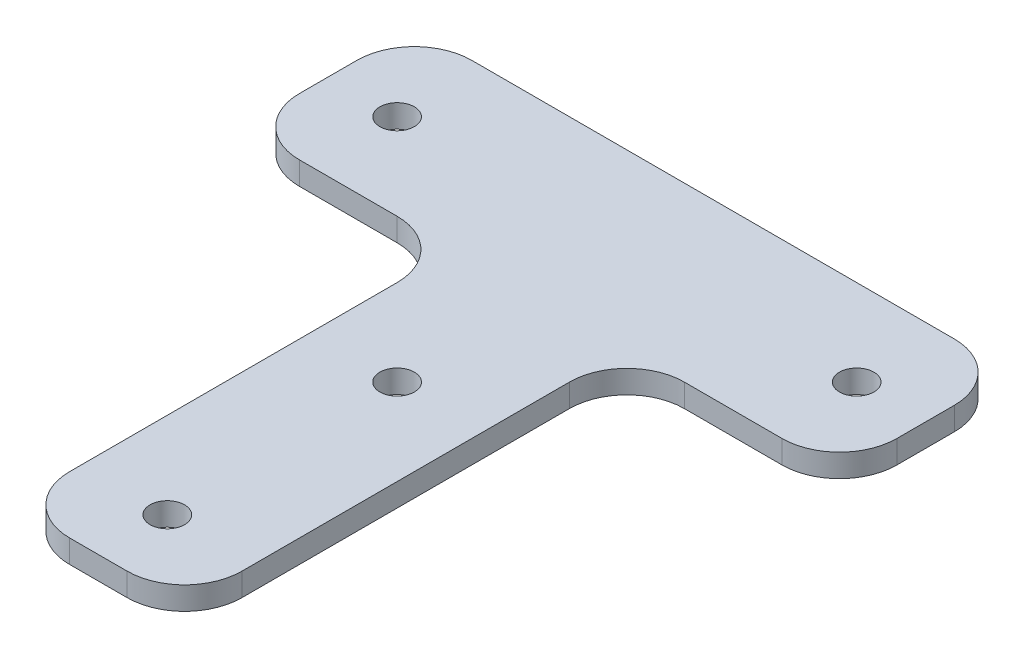
ISO-10303-21;
HEADER;
FILE_DESCRIPTION(('STEP AP214'),'2;1');
FILE_NAME('part.step','',(''),(''),'','','');
FILE_SCHEMA(('AUTOMOTIVE_DESIGN { 1 0 10303 214 1 1 1 1 }'));
ENDSEC;
DATA;
#1=APPLICATION_CONTEXT('core data for automotive mechanical design processes');
#2=APPLICATION_PROTOCOL_DEFINITION('international standard','automotive_design',2000,#1);
#3=PRODUCT_CONTEXT('',#1,'mechanical');
#4=PRODUCT('Part','Part','',(#3));
#5=PRODUCT_RELATED_PRODUCT_CATEGORY('part','',(#4));
#6=PRODUCT_DEFINITION_FORMATION('','',#4);
#7=PRODUCT_DEFINITION_CONTEXT('part definition',#1,'design');
#8=PRODUCT_DEFINITION('design','',#6,#7);
#9=PRODUCT_DEFINITION_SHAPE('','',#8);
#10=(LENGTH_UNIT() NAMED_UNIT(*) SI_UNIT(.MILLI.,.METRE.));
#11=(NAMED_UNIT(*) PLANE_ANGLE_UNIT() SI_UNIT($,.RADIAN.));
#12=(NAMED_UNIT(*) SI_UNIT($,.STERADIAN.) SOLID_ANGLE_UNIT());
#13=UNCERTAINTY_MEASURE_WITH_UNIT(LENGTH_MEASURE(1.E-05),#10,'distance_accuracy_value','');
#14=(GEOMETRIC_REPRESENTATION_CONTEXT(3) GLOBAL_UNCERTAINTY_ASSIGNED_CONTEXT((#13)) GLOBAL_UNIT_ASSIGNED_CONTEXT((#10,
#11,#12)) REPRESENTATION_CONTEXT('',''));
#15=CARTESIAN_POINT('',(0.,0.,0.));
#16=DIRECTION('',(0.,0.,1.));
#17=DIRECTION('',(1.,0.,0.));
#18=AXIS2_PLACEMENT_3D('',#15,#16,#17);
#19=CARTESIAN_POINT('',(0.,2.,0.));
#20=DIRECTION('',(0.,-1.,0.));
#21=DIRECTION('',(0.,0.,-1.));
#22=AXIS2_PLACEMENT_3D('',#19,#20,#21);
#23=PLANE('',#22);
#24=DIRECTION('',(0.,0.,1.));
#25=VECTOR('',#24,1.);
#26=CARTESIAN_POINT('',(-26.,2.,7.49999999999999));
#27=LINE('',#26,#25);
#28=CARTESIAN_POINT('',(-26.,2.,-2.49999999999999));
#29=VERTEX_POINT('',#28);
#30=CARTESIAN_POINT('',(-26.,2.,2.5));
#31=VERTEX_POINT('',#30);
#32=EDGE_CURVE('E306',#29,#31,#27,.T.);
#33=ORIENTED_EDGE('',*,*,#32,.T.);
#34=CARTESIAN_POINT('',(-21.,2.,2.5));
#35=DIRECTION('',(0.,-1.,0.));
#36=DIRECTION('',(0.,0.,-1.));
#37=AXIS2_PLACEMENT_3D('',#34,#35,#36);
#38=CIRCLE('',#37,5.);
#39=CARTESIAN_POINT('',(-21.,2.,7.5));
#40=VERTEX_POINT('',#39);
#41=EDGE_CURVE('E227',#31,#40,#38,.F.);
#42=ORIENTED_EDGE('',*,*,#41,.T.);
#43=DIRECTION('',(1.,0.,0.));
#44=VECTOR('',#43,1.);
#45=CARTESIAN_POINT('',(-7.5,2.,7.5));
#46=LINE('',#45,#44);
#47=CARTESIAN_POINT('',(-12.5,2.,7.5));
#48=VERTEX_POINT('',#47);
#49=EDGE_CURVE('E178',#40,#48,#46,.T.);
#50=ORIENTED_EDGE('',*,*,#49,.T.);
#51=CARTESIAN_POINT('',(-12.5,2.,12.5));
#52=DIRECTION('',(0.,-1.,0.));
#53=DIRECTION('',(0.,0.,-1.));
#54=AXIS2_PLACEMENT_3D('',#51,#52,#53);
#55=CIRCLE('',#54,5.);
#56=CARTESIAN_POINT('',(-7.5,2.,12.5));
#57=VERTEX_POINT('',#56);
#58=EDGE_CURVE('E67',#48,#57,#55,.T.);
#59=ORIENTED_EDGE('',*,*,#58,.T.);
#60=DIRECTION('',(0.,0.,1.));
#61=VECTOR('',#60,1.);
#62=CARTESIAN_POINT('',(-7.49999999999999,2.,46.));
#63=LINE('',#62,#61);
#64=CARTESIAN_POINT('',(-7.5,2.,41.));
#65=VERTEX_POINT('',#64);
#66=EDGE_CURVE('E196',#57,#65,#63,.T.);
#67=ORIENTED_EDGE('',*,*,#66,.T.);
#68=CARTESIAN_POINT('',(-2.5,2.,41.));
#69=DIRECTION('',(0.,-1.,0.));
#70=DIRECTION('',(0.,0.,-1.));
#71=AXIS2_PLACEMENT_3D('',#68,#69,#70);
#72=CIRCLE('',#71,5.);
#73=CARTESIAN_POINT('',(-2.5,2.,46.));
#74=VERTEX_POINT('',#73);
#75=EDGE_CURVE('E213',#65,#74,#72,.F.);
#76=ORIENTED_EDGE('',*,*,#75,.T.);
#77=DIRECTION('',(1.,0.,0.));
#78=VECTOR('',#77,1.);
#79=CARTESIAN_POINT('',(7.50000000000001,2.,46.));
#80=LINE('',#79,#78);
#81=CARTESIAN_POINT('',(2.5,2.,46.));
#82=VERTEX_POINT('',#81);
#83=EDGE_CURVE('E190',#74,#82,#80,.T.);
#84=ORIENTED_EDGE('',*,*,#83,.T.);
#85=CARTESIAN_POINT('',(2.5,2.,41.));
#86=DIRECTION('',(0.,-1.,0.));
#87=DIRECTION('',(0.,0.,-1.));
#88=AXIS2_PLACEMENT_3D('',#85,#86,#87);
#89=CIRCLE('',#88,5.);
#90=CARTESIAN_POINT('',(7.50000000000001,2.,41.));
#91=VERTEX_POINT('',#90);
#92=EDGE_CURVE('E215',#82,#91,#89,.F.);
#93=ORIENTED_EDGE('',*,*,#92,.T.);
#94=DIRECTION('',(0.,0.,-1.));
#95=VECTOR('',#94,1.);
#96=CARTESIAN_POINT('',(7.50000000000001,2.,46.));
#97=LINE('',#96,#95);
#98=CARTESIAN_POINT('',(7.5,2.,12.5));
#99=VERTEX_POINT('',#98);
#100=EDGE_CURVE('E290',#91,#99,#97,.T.);
#101=ORIENTED_EDGE('',*,*,#100,.T.);
#102=CARTESIAN_POINT('',(12.5,2.,12.5));
#103=DIRECTION('',(0.,-1.,0.));
#104=DIRECTION('',(0.,0.,-1.));
#105=AXIS2_PLACEMENT_3D('',#102,#103,#104);
#106=CIRCLE('',#105,5.);
#107=CARTESIAN_POINT('',(12.5,2.,7.5));
#108=VERTEX_POINT('',#107);
#109=EDGE_CURVE('E11',#99,#108,#106,.T.);
#110=ORIENTED_EDGE('',*,*,#109,.T.);
#111=DIRECTION('',(1.,0.,0.));
#112=VECTOR('',#111,1.);
#113=CARTESIAN_POINT('',(7.5,2.,7.5));
#114=LINE('',#113,#112);
#115=CARTESIAN_POINT('',(21.,2.,7.5));
#116=VERTEX_POINT('',#115);
#117=EDGE_CURVE('E288',#108,#116,#114,.T.);
#118=ORIENTED_EDGE('',*,*,#117,.T.);
#119=CARTESIAN_POINT('',(21.,2.,2.5));
#120=DIRECTION('',(0.,-1.,0.));
#121=DIRECTION('',(0.,0.,-1.));
#122=AXIS2_PLACEMENT_3D('',#119,#120,#121);
#123=CIRCLE('',#122,5.);
#124=CARTESIAN_POINT('',(26.,2.,2.5));
#125=VERTEX_POINT('',#124);
#126=EDGE_CURVE('E218',#116,#125,#123,.F.);
#127=ORIENTED_EDGE('',*,*,#126,.T.);
#128=DIRECTION('',(0.,0.,-1.));
#129=VECTOR('',#128,1.);
#130=CARTESIAN_POINT('',(26.,2.,7.5));
#131=LINE('',#130,#129);
#132=CARTESIAN_POINT('',(26.,2.,-2.5));
#133=VERTEX_POINT('',#132);
#134=EDGE_CURVE('E294',#125,#133,#131,.T.);
#135=ORIENTED_EDGE('',*,*,#134,.T.);
#136=CARTESIAN_POINT('',(21.,2.,-2.5));
#137=DIRECTION('',(0.,-1.,0.));
#138=DIRECTION('',(0.,0.,-1.));
#139=AXIS2_PLACEMENT_3D('',#136,#137,#138);
#140=CIRCLE('',#139,5.);
#141=CARTESIAN_POINT('',(21.,2.,-7.5));
#142=VERTEX_POINT('',#141);
#143=EDGE_CURVE('E221',#133,#142,#140,.F.);
#144=ORIENTED_EDGE('',*,*,#143,.T.);
#145=DIRECTION('',(-1.,0.,0.));
#146=VECTOR('',#145,1.);
#147=CARTESIAN_POINT('',(26.,2.,-7.5));
#148=LINE('',#147,#146);
#149=CARTESIAN_POINT('',(-21.,2.,-7.49999999999999));
#150=VERTEX_POINT('',#149);
#151=EDGE_CURVE('E298',#142,#150,#148,.T.);
#152=ORIENTED_EDGE('',*,*,#151,.T.);
#153=CARTESIAN_POINT('',(-21.,2.,-2.49999999999999));
#154=DIRECTION('',(0.,-1.,0.));
#155=DIRECTION('',(0.,0.,-1.));
#156=AXIS2_PLACEMENT_3D('',#153,#154,#155);
#157=CIRCLE('',#156,5.);
#158=EDGE_CURVE('E224',#150,#29,#157,.F.);
#159=ORIENTED_EDGE('',*,*,#158,.T.);
#160=EDGE_LOOP('',(#33,#42,#50,#59,#67,#76,#84,#93,#101,#110,#118,#127,#135,#144,#152,#159));
#161=FACE_BOUND('',#160,.T.);
#162=CARTESIAN_POINT('',(0.,2.,40.));
#163=DIRECTION('',(0.,1.,0.));
#164=DIRECTION('',(0.,0.,1.));
#165=AXIS2_PLACEMENT_3D('',#162,#163,#164);
#166=CIRCLE('',#165,1.5);
#167=CARTESIAN_POINT('',(0.,2.,41.5));
#168=VERTEX_POINT('',#167);
#169=EDGE_CURVE('E313',#168,#168,#166,.T.);
#170=ORIENTED_EDGE('',*,*,#169,.F.);
#171=EDGE_LOOP('',(#170));
#172=FACE_BOUND('',#171,.T.);
#173=CARTESIAN_POINT('',(0.,2.,20.));
#174=DIRECTION('',(0.,1.,0.));
#175=DIRECTION('',(0.,0.,1.));
#176=AXIS2_PLACEMENT_3D('',#173,#174,#175);
#177=CIRCLE('',#176,1.5);
#178=CARTESIAN_POINT('',(0.,2.,21.5));
#179=VERTEX_POINT('',#178);
#180=EDGE_CURVE('E383',#179,#179,#177,.T.);
#181=ORIENTED_EDGE('',*,*,#180,.F.);
#182=EDGE_LOOP('',(#181));
#183=FACE_BOUND('',#182,.T.);
#184=CARTESIAN_POINT('',(20.,2.,0.));
#185=DIRECTION('',(0.,1.,0.));
#186=DIRECTION('',(0.,0.,1.));
#187=AXIS2_PLACEMENT_3D('',#184,#185,#186);
#188=CIRCLE('',#187,1.5);
#189=CARTESIAN_POINT('',(20.,2.,1.5));
#190=VERTEX_POINT('',#189);
#191=EDGE_CURVE('E391',#190,#190,#188,.T.);
#192=ORIENTED_EDGE('',*,*,#191,.F.);
#193=EDGE_LOOP('',(#192));
#194=FACE_BOUND('',#193,.T.);
#195=CARTESIAN_POINT('',(-20.,2.,0.));
#196=DIRECTION('',(0.,1.,0.));
#197=DIRECTION('',(0.,0.,-1.));
#198=AXIS2_PLACEMENT_3D('',#195,#196,#197);
#199=CIRCLE('',#198,1.5);
#200=CARTESIAN_POINT('',(-20.,2.,-1.5));
#201=VERTEX_POINT('',#200);
#202=EDGE_CURVE('E399',#201,#201,#199,.T.);
#203=ORIENTED_EDGE('',*,*,#202,.F.);
#204=EDGE_LOOP('',(#203));
#205=FACE_BOUND('',#204,.T.);
#206=ADVANCED_FACE('F45',(#161,#172,#183,#194,#205),#23,.F.);
#207=CARTESIAN_POINT('',(0.,0.,0.));
#208=DIRECTION('',(0.,-1.,0.));
#209=DIRECTION('',(0.,0.,-1.));
#210=AXIS2_PLACEMENT_3D('',#207,#208,#209);
#211=PLANE('',#210);
#212=CARTESIAN_POINT('',(20.,0.,0.));
#213=DIRECTION('',(0.,1.,0.));
#214=DIRECTION('',(0.,0.,1.));
#215=AXIS2_PLACEMENT_3D('',#212,#213,#214);
#216=CIRCLE('',#215,1.5);
#217=CARTESIAN_POINT('',(20.,0.,1.5));
#218=VERTEX_POINT('',#217);
#219=EDGE_CURVE('E395',#218,#218,#216,.T.);
#220=ORIENTED_EDGE('',*,*,#219,.T.);
#221=EDGE_LOOP('',(#220));
#222=FACE_BOUND('',#221,.T.);
#223=CARTESIAN_POINT('',(0.,0.,40.));
#224=DIRECTION('',(0.,1.,0.));
#225=DIRECTION('',(0.,0.,1.));
#226=AXIS2_PLACEMENT_3D('',#223,#224,#225);
#227=CIRCLE('',#226,1.5);
#228=CARTESIAN_POINT('',(0.,0.,41.5));
#229=VERTEX_POINT('',#228);
#230=EDGE_CURVE('E379',#229,#229,#227,.T.);
#231=ORIENTED_EDGE('',*,*,#230,.T.);
#232=EDGE_LOOP('',(#231));
#233=FACE_BOUND('',#232,.T.);
#234=DIRECTION('',(1.,0.,0.));
#235=VECTOR('',#234,1.);
#236=CARTESIAN_POINT('',(-7.5,0.,7.5));
#237=LINE('',#236,#235);
#238=CARTESIAN_POINT('',(-21.,0.,7.5));
#239=VERTEX_POINT('',#238);
#240=CARTESIAN_POINT('',(-12.5,0.,7.5));
#241=VERTEX_POINT('',#240);
#242=EDGE_CURVE('E176',#239,#241,#237,.T.);
#243=ORIENTED_EDGE('',*,*,#242,.F.);
#244=CARTESIAN_POINT('',(-21.,0.,2.5));
#245=DIRECTION('',(0.,-1.,0.));
#246=DIRECTION('',(0.,0.,-1.));
#247=AXIS2_PLACEMENT_3D('',#244,#245,#246);
#248=CIRCLE('',#247,5.);
#249=CARTESIAN_POINT('',(-26.,0.,2.5));
#250=VERTEX_POINT('',#249);
#251=EDGE_CURVE('E159',#239,#250,#248,.T.);
#252=ORIENTED_EDGE('',*,*,#251,.T.);
#253=DIRECTION('',(0.,0.,1.));
#254=VECTOR('',#253,1.);
#255=CARTESIAN_POINT('',(-26.,0.,7.49999999999999));
#256=LINE('',#255,#254);
#257=CARTESIAN_POINT('',(-26.,0.,-2.49999999999999));
#258=VERTEX_POINT('',#257);
#259=EDGE_CURVE('E187',#258,#250,#256,.T.);
#260=ORIENTED_EDGE('',*,*,#259,.F.);
#261=CARTESIAN_POINT('',(-21.,0.,-2.49999999999999));
#262=DIRECTION('',(0.,-1.,0.));
#263=DIRECTION('',(0.,0.,-1.));
#264=AXIS2_PLACEMENT_3D('',#261,#262,#263);
#265=CIRCLE('',#264,5.);
#266=CARTESIAN_POINT('',(-21.,0.,-7.49999999999999));
#267=VERTEX_POINT('',#266);
#268=EDGE_CURVE('E170',#258,#267,#265,.T.);
#269=ORIENTED_EDGE('',*,*,#268,.T.);
#270=DIRECTION('',(-1.,0.,0.));
#271=VECTOR('',#270,1.);
#272=CARTESIAN_POINT('',(26.,0.,-7.5));
#273=LINE('',#272,#271);
#274=CARTESIAN_POINT('',(21.,0.,-7.5));
#275=VERTEX_POINT('',#274);
#276=EDGE_CURVE('E192',#275,#267,#273,.T.);
#277=ORIENTED_EDGE('',*,*,#276,.F.);
#278=CARTESIAN_POINT('',(21.,0.,-2.5));
#279=DIRECTION('',(0.,-1.,0.));
#280=DIRECTION('',(0.,0.,-1.));
#281=AXIS2_PLACEMENT_3D('',#278,#279,#280);
#282=CIRCLE('',#281,5.);
#283=CARTESIAN_POINT('',(26.,0.,-2.5));
#284=VERTEX_POINT('',#283);
#285=EDGE_CURVE('E205',#275,#284,#282,.T.);
#286=ORIENTED_EDGE('',*,*,#285,.T.);
#287=DIRECTION('',(0.,0.,-1.));
#288=VECTOR('',#287,1.);
#289=CARTESIAN_POINT('',(26.,0.,7.5));
#290=LINE('',#289,#288);
#291=CARTESIAN_POINT('',(26.,0.,2.5));
#292=VERTEX_POINT('',#291);
#293=EDGE_CURVE('E317',#292,#284,#290,.T.);
#294=ORIENTED_EDGE('',*,*,#293,.F.);
#295=CARTESIAN_POINT('',(21.,0.,2.5));
#296=DIRECTION('',(0.,-1.,0.));
#297=DIRECTION('',(0.,0.,-1.));
#298=AXIS2_PLACEMENT_3D('',#295,#296,#297);
#299=CIRCLE('',#298,5.);
#300=CARTESIAN_POINT('',(21.,0.,7.5));
#301=VERTEX_POINT('',#300);
#302=EDGE_CURVE('E202',#292,#301,#299,.T.);
#303=ORIENTED_EDGE('',*,*,#302,.T.);
#304=DIRECTION('',(1.,0.,0.));
#305=VECTOR('',#304,1.);
#306=CARTESIAN_POINT('',(7.5,0.,7.5));
#307=LINE('',#306,#305);
#308=CARTESIAN_POINT('',(12.5,0.,7.5));
#309=VERTEX_POINT('',#308);
#310=EDGE_CURVE('E271',#309,#301,#307,.T.);
#311=ORIENTED_EDGE('',*,*,#310,.F.);
#312=CARTESIAN_POINT('',(12.5,0.,12.5));
#313=DIRECTION('',(0.,-1.,0.));
#314=DIRECTION('',(0.,0.,-1.));
#315=AXIS2_PLACEMENT_3D('',#312,#313,#314);
#316=CIRCLE('',#315,5.);
#317=CARTESIAN_POINT('',(7.5,0.,12.5));
#318=VERTEX_POINT('',#317);
#319=EDGE_CURVE('E53',#309,#318,#316,.F.);
#320=ORIENTED_EDGE('',*,*,#319,.T.);
#321=DIRECTION('',(0.,0.,-1.));
#322=VECTOR('',#321,1.);
#323=CARTESIAN_POINT('',(7.50000000000001,0.,46.));
#324=LINE('',#323,#322);
#325=CARTESIAN_POINT('',(7.50000000000001,0.,41.));
#326=VERTEX_POINT('',#325);
#327=EDGE_CURVE('E269',#326,#318,#324,.T.);
#328=ORIENTED_EDGE('',*,*,#327,.F.);
#329=CARTESIAN_POINT('',(2.5,0.,41.));
#330=DIRECTION('',(0.,-1.,0.));
#331=DIRECTION('',(0.,0.,-1.));
#332=AXIS2_PLACEMENT_3D('',#329,#330,#331);
#333=CIRCLE('',#332,5.);
#334=CARTESIAN_POINT('',(2.5,0.,46.));
#335=VERTEX_POINT('',#334);
#336=EDGE_CURVE('E200',#326,#335,#333,.T.);
#337=ORIENTED_EDGE('',*,*,#336,.T.);
#338=DIRECTION('',(1.,0.,0.));
#339=VECTOR('',#338,1.);
#340=CARTESIAN_POINT('',(7.50000000000001,0.,46.));
#341=LINE('',#340,#339);
#342=CARTESIAN_POINT('',(-2.5,0.,46.));
#343=VERTEX_POINT('',#342);
#344=EDGE_CURVE('E281',#343,#335,#341,.T.);
#345=ORIENTED_EDGE('',*,*,#344,.F.);
#346=CARTESIAN_POINT('',(-2.5,0.,41.));
#347=DIRECTION('',(0.,-1.,0.));
#348=DIRECTION('',(0.,0.,-1.));
#349=AXIS2_PLACEMENT_3D('',#346,#347,#348);
#350=CIRCLE('',#349,5.);
#351=CARTESIAN_POINT('',(-7.5,0.,41.));
#352=VERTEX_POINT('',#351);
#353=EDGE_CURVE('E179',#343,#352,#350,.T.);
#354=ORIENTED_EDGE('',*,*,#353,.T.);
#355=DIRECTION('',(0.,0.,1.));
#356=VECTOR('',#355,1.);
#357=CARTESIAN_POINT('',(-7.49999999999999,0.,46.));
#358=LINE('',#357,#356);
#359=CARTESIAN_POINT('',(-7.5,0.,12.5));
#360=VERTEX_POINT('',#359);
#361=EDGE_CURVE('E186',#360,#352,#358,.T.);
#362=ORIENTED_EDGE('',*,*,#361,.F.);
#363=CARTESIAN_POINT('',(-12.5,0.,12.5));
#364=DIRECTION('',(0.,-1.,0.));
#365=DIRECTION('',(0.,0.,-1.));
#366=AXIS2_PLACEMENT_3D('',#363,#364,#365);
#367=CIRCLE('',#366,5.);
#368=EDGE_CURVE('E185',#360,#241,#367,.F.);
#369=ORIENTED_EDGE('',*,*,#368,.T.);
#370=EDGE_LOOP('',(#243,#252,#260,#269,#277,#286,#294,#303,#311,#320,#328,#337,#345,#354,#362,#369));
#371=FACE_BOUND('',#370,.T.);
#372=CARTESIAN_POINT('',(0.,0.,20.));
#373=DIRECTION('',(0.,1.,0.));
#374=DIRECTION('',(0.,0.,1.));
#375=AXIS2_PLACEMENT_3D('',#372,#373,#374);
#376=CIRCLE('',#375,1.5);
#377=CARTESIAN_POINT('',(0.,0.,21.5));
#378=VERTEX_POINT('',#377);
#379=EDGE_CURVE('E387',#378,#378,#376,.T.);
#380=ORIENTED_EDGE('',*,*,#379,.T.);
#381=EDGE_LOOP('',(#380));
#382=FACE_BOUND('',#381,.T.);
#383=CARTESIAN_POINT('',(-20.,0.,0.));
#384=DIRECTION('',(0.,1.,0.));
#385=DIRECTION('',(0.,0.,-1.));
#386=AXIS2_PLACEMENT_3D('',#383,#384,#385);
#387=CIRCLE('',#386,1.5);
#388=CARTESIAN_POINT('',(-20.,0.,-1.5));
#389=VERTEX_POINT('',#388);
#390=EDGE_CURVE('E403',#389,#389,#387,.T.);
#391=ORIENTED_EDGE('',*,*,#390,.T.);
#392=EDGE_LOOP('',(#391));
#393=FACE_BOUND('',#392,.T.);
#394=ADVANCED_FACE('F182',(#222,#233,#371,#382,#393),#211,.T.);
#395=CARTESIAN_POINT('',(7.50000000000001,2.,46.));
#396=DIRECTION('',(0.,0.,-1.));
#397=DIRECTION('',(-1.,0.,0.));
#398=AXIS2_PLACEMENT_3D('',#395,#396,#397);
#399=PLANE('',#398);
#400=ORIENTED_EDGE('',*,*,#344,.T.);
#401=DIRECTION('',(0.,-1.,0.));
#402=VECTOR('',#401,1.);
#403=CARTESIAN_POINT('',(2.5,2.,46.));
#404=LINE('',#403,#402);
#405=EDGE_CURVE('E254',#335,#82,#404,.F.);
#406=ORIENTED_EDGE('',*,*,#405,.T.);
#407=ORIENTED_EDGE('',*,*,#83,.F.);
#408=DIRECTION('',(0.,-1.,0.));
#409=VECTOR('',#408,1.);
#410=CARTESIAN_POINT('',(-2.5,2.,46.));
#411=LINE('',#410,#409);
#412=EDGE_CURVE('E250',#74,#343,#411,.T.);
#413=ORIENTED_EDGE('',*,*,#412,.T.);
#414=EDGE_LOOP('',(#400,#406,#407,#413));
#415=FACE_BOUND('',#414,.T.);
#416=ADVANCED_FACE('F353',(#415),#399,.F.);
#417=CARTESIAN_POINT('',(7.50000000000001,2.,46.));
#418=DIRECTION('',(-1.,0.,0.));
#419=DIRECTION('',(0.,0.,1.));
#420=AXIS2_PLACEMENT_3D('',#417,#418,#419);
#421=PLANE('',#420);
#422=ORIENTED_EDGE('',*,*,#100,.F.);
#423=DIRECTION('',(0.,-1.,0.));
#424=VECTOR('',#423,1.);
#425=CARTESIAN_POINT('',(7.50000000000001,2.,41.));
#426=LINE('',#425,#424);
#427=EDGE_CURVE('E247',#91,#326,#426,.T.);
#428=ORIENTED_EDGE('',*,*,#427,.T.);
#429=ORIENTED_EDGE('',*,*,#327,.T.);
#430=DIRECTION('',(0.,-1.,0.));
#431=VECTOR('',#430,1.);
#432=CARTESIAN_POINT('',(7.5,2.,12.5));
#433=LINE('',#432,#431);
#434=EDGE_CURVE('E244',#318,#99,#433,.F.);
#435=ORIENTED_EDGE('',*,*,#434,.T.);
#436=EDGE_LOOP('',(#422,#428,#429,#435));
#437=FACE_BOUND('',#436,.T.);
#438=ADVANCED_FACE('F277',(#437),#421,.F.);
#439=CARTESIAN_POINT('',(7.5,2.,7.5));
#440=DIRECTION('',(0.,0.,-1.));
#441=DIRECTION('',(-1.,0.,0.));
#442=AXIS2_PLACEMENT_3D('',#439,#440,#441);
#443=PLANE('',#442);
#444=ORIENTED_EDGE('',*,*,#310,.T.);
#445=DIRECTION('',(0.,-1.,0.));
#446=VECTOR('',#445,1.);
#447=CARTESIAN_POINT('',(21.,2.,7.5));
#448=LINE('',#447,#446);
#449=EDGE_CURVE('E242',#301,#116,#448,.F.);
#450=ORIENTED_EDGE('',*,*,#449,.T.);
#451=ORIENTED_EDGE('',*,*,#117,.F.);
#452=DIRECTION('',(0.,-1.,0.));
#453=VECTOR('',#452,1.);
#454=CARTESIAN_POINT('',(12.5,0.,7.5));
#455=LINE('',#454,#453);
#456=EDGE_CURVE('E239',#108,#309,#455,.T.);
#457=ORIENTED_EDGE('',*,*,#456,.T.);
#458=EDGE_LOOP('',(#444,#450,#451,#457));
#459=FACE_BOUND('',#458,.T.);
#460=ADVANCED_FACE('F292',(#459),#443,.F.);
#461=CARTESIAN_POINT('',(26.,2.,7.5));
#462=DIRECTION('',(-1.,0.,0.));
#463=DIRECTION('',(0.,0.,1.));
#464=AXIS2_PLACEMENT_3D('',#461,#462,#463);
#465=PLANE('',#464);
#466=ORIENTED_EDGE('',*,*,#293,.T.);
#467=DIRECTION('',(0.,-1.,0.));
#468=VECTOR('',#467,1.);
#469=CARTESIAN_POINT('',(26.,2.,-2.5));
#470=LINE('',#469,#468);
#471=EDGE_CURVE('E237',#284,#133,#470,.F.);
#472=ORIENTED_EDGE('',*,*,#471,.T.);
#473=ORIENTED_EDGE('',*,*,#134,.F.);
#474=DIRECTION('',(0.,-1.,0.));
#475=VECTOR('',#474,1.);
#476=CARTESIAN_POINT('',(26.,2.,2.5));
#477=LINE('',#476,#475);
#478=EDGE_CURVE('E234',#125,#292,#477,.T.);
#479=ORIENTED_EDGE('',*,*,#478,.T.);
#480=EDGE_LOOP('',(#466,#472,#473,#479));
#481=FACE_BOUND('',#480,.T.);
#482=ADVANCED_FACE('F345',(#481),#465,.F.);
#483=CARTESIAN_POINT('',(26.,2.,-7.5));
#484=DIRECTION('',(0.,0.,1.));
#485=DIRECTION('',(1.,0.,0.));
#486=AXIS2_PLACEMENT_3D('',#483,#484,#485);
#487=PLANE('',#486);
#488=ORIENTED_EDGE('',*,*,#276,.T.);
#489=DIRECTION('',(0.,-1.,0.));
#490=VECTOR('',#489,1.);
#491=CARTESIAN_POINT('',(-21.,2.,-7.49999999999999));
#492=LINE('',#491,#490);
#493=EDGE_CURVE('E232',#267,#150,#492,.F.);
#494=ORIENTED_EDGE('',*,*,#493,.T.);
#495=ORIENTED_EDGE('',*,*,#151,.F.);
#496=DIRECTION('',(0.,-1.,0.));
#497=VECTOR('',#496,1.);
#498=CARTESIAN_POINT('',(21.,2.,-7.5));
#499=LINE('',#498,#497);
#500=EDGE_CURVE('E229',#142,#275,#499,.T.);
#501=ORIENTED_EDGE('',*,*,#500,.T.);
#502=EDGE_LOOP('',(#488,#494,#495,#501));
#503=FACE_BOUND('',#502,.T.);
#504=ADVANCED_FACE('F325',(#503),#487,.F.);
#505=CARTESIAN_POINT('',(-26.,2.,7.49999999999999));
#506=DIRECTION('',(1.,0.,0.));
#507=DIRECTION('',(0.,0.,-1.));
#508=AXIS2_PLACEMENT_3D('',#505,#506,#507);
#509=PLANE('',#508);
#510=ORIENTED_EDGE('',*,*,#259,.T.);
#511=DIRECTION('',(0.,-1.,0.));
#512=VECTOR('',#511,1.);
#513=CARTESIAN_POINT('',(-26.,2.,2.5));
#514=LINE('',#513,#512);
#515=EDGE_CURVE('E164',#250,#31,#514,.F.);
#516=ORIENTED_EDGE('',*,*,#515,.T.);
#517=ORIENTED_EDGE('',*,*,#32,.F.);
#518=DIRECTION('',(0.,-1.,0.));
#519=VECTOR('',#518,1.);
#520=CARTESIAN_POINT('',(-26.,2.,-2.49999999999999));
#521=LINE('',#520,#519);
#522=EDGE_CURVE('E169',#29,#258,#521,.T.);
#523=ORIENTED_EDGE('',*,*,#522,.T.);
#524=EDGE_LOOP('',(#510,#516,#517,#523));
#525=FACE_BOUND('',#524,.T.);
#526=ADVANCED_FACE('F334',(#525),#509,.F.);
#527=CARTESIAN_POINT('',(-7.5,2.,7.5));
#528=DIRECTION('',(0.,0.,-1.));
#529=DIRECTION('',(-1.,0.,0.));
#530=AXIS2_PLACEMENT_3D('',#527,#528,#529);
#531=PLANE('',#530);
#532=ORIENTED_EDGE('',*,*,#49,.F.);
#533=DIRECTION('',(0.,-1.,0.));
#534=VECTOR('',#533,1.);
#535=CARTESIAN_POINT('',(-21.,2.,7.5));
#536=LINE('',#535,#534);
#537=EDGE_CURVE('E163',#40,#239,#536,.T.);
#538=ORIENTED_EDGE('',*,*,#537,.T.);
#539=ORIENTED_EDGE('',*,*,#242,.T.);
#540=DIRECTION('',(0.,-1.,0.));
#541=VECTOR('',#540,1.);
#542=CARTESIAN_POINT('',(-12.5,2.,7.5));
#543=LINE('',#542,#541);
#544=EDGE_CURVE('E180',#241,#48,#543,.F.);
#545=ORIENTED_EDGE('',*,*,#544,.T.);
#546=EDGE_LOOP('',(#532,#538,#539,#545));
#547=FACE_BOUND('',#546,.T.);
#548=ADVANCED_FACE('F175',(#547),#531,.F.);
#549=CARTESIAN_POINT('',(-7.49999999999999,2.,46.));
#550=DIRECTION('',(1.,0.,0.));
#551=DIRECTION('',(0.,0.,-1.));
#552=AXIS2_PLACEMENT_3D('',#549,#550,#551);
#553=PLANE('',#552);
#554=ORIENTED_EDGE('',*,*,#361,.T.);
#555=DIRECTION('',(0.,-1.,0.));
#556=VECTOR('',#555,1.);
#557=CARTESIAN_POINT('',(-7.5,2.,41.));
#558=LINE('',#557,#556);
#559=EDGE_CURVE('E60',#352,#65,#558,.F.);
#560=ORIENTED_EDGE('',*,*,#559,.T.);
#561=ORIENTED_EDGE('',*,*,#66,.F.);
#562=DIRECTION('',(0.,-1.,0.));
#563=VECTOR('',#562,1.);
#564=CARTESIAN_POINT('',(-7.5,0.,12.5));
#565=LINE('',#564,#563);
#566=EDGE_CURVE('E256',#57,#360,#565,.T.);
#567=ORIENTED_EDGE('',*,*,#566,.T.);
#568=EDGE_LOOP('',(#554,#560,#561,#567));
#569=FACE_BOUND('',#568,.T.);
#570=ADVANCED_FACE('F342',(#569),#553,.F.);
#571=CARTESIAN_POINT('',(0.,2.,40.));
#572=DIRECTION('',(0.,-1.,0.));
#573=DIRECTION('',(0.,0.,-1.));
#574=AXIS2_PLACEMENT_3D('',#571,#572,#573);
#575=CYLINDRICAL_SURFACE('',#574,1.5);
#576=ORIENTED_EDGE('',*,*,#169,.T.);
#577=EDGE_LOOP('',(#576));
#578=FACE_BOUND('',#577,.T.);
#579=ORIENTED_EDGE('',*,*,#230,.F.);
#580=EDGE_LOOP('',(#579));
#581=FACE_BOUND('',#580,.T.);
#582=ADVANCED_FACE('F357',(#578,#581),#575,.F.);
#583=CARTESIAN_POINT('',(0.,2.,20.));
#584=DIRECTION('',(0.,-1.,0.));
#585=DIRECTION('',(0.,0.,-1.));
#586=AXIS2_PLACEMENT_3D('',#583,#584,#585);
#587=CYLINDRICAL_SURFACE('',#586,1.5);
#588=ORIENTED_EDGE('',*,*,#180,.T.);
#589=EDGE_LOOP('',(#588));
#590=FACE_BOUND('',#589,.T.);
#591=ORIENTED_EDGE('',*,*,#379,.F.);
#592=EDGE_LOOP('',(#591));
#593=FACE_BOUND('',#592,.T.);
#594=ADVANCED_FACE('F365',(#590,#593),#587,.F.);
#595=CARTESIAN_POINT('',(20.,2.,0.));
#596=DIRECTION('',(0.,-1.,0.));
#597=DIRECTION('',(0.,0.,-1.));
#598=AXIS2_PLACEMENT_3D('',#595,#596,#597);
#599=CYLINDRICAL_SURFACE('',#598,1.5);
#600=ORIENTED_EDGE('',*,*,#191,.T.);
#601=EDGE_LOOP('',(#600));
#602=FACE_BOUND('',#601,.T.);
#603=ORIENTED_EDGE('',*,*,#219,.F.);
#604=EDGE_LOOP('',(#603));
#605=FACE_BOUND('',#604,.T.);
#606=ADVANCED_FACE('F415',(#602,#605),#599,.F.);
#607=CARTESIAN_POINT('',(-20.,2.,0.));
#608=DIRECTION('',(0.,-1.,0.));
#609=DIRECTION('',(0.,0.,-1.));
#610=AXIS2_PLACEMENT_3D('',#607,#608,#609);
#611=CYLINDRICAL_SURFACE('',#610,1.5);
#612=ORIENTED_EDGE('',*,*,#202,.T.);
#613=EDGE_LOOP('',(#612));
#614=FACE_BOUND('',#613,.T.);
#615=ORIENTED_EDGE('',*,*,#390,.F.);
#616=EDGE_LOOP('',(#615));
#617=FACE_BOUND('',#616,.T.);
#618=ADVANCED_FACE('F411',(#614,#617),#611,.F.);
#619=CARTESIAN_POINT('',(-21.,2.,2.5));
#620=DIRECTION('',(0.,-1.,0.));
#621=DIRECTION('',(0.,0.,-1.));
#622=AXIS2_PLACEMENT_3D('',#619,#620,#621);
#623=CYLINDRICAL_SURFACE('',#622,5.);
#624=ORIENTED_EDGE('',*,*,#41,.F.);
#625=ORIENTED_EDGE('',*,*,#515,.F.);
#626=ORIENTED_EDGE('',*,*,#251,.F.);
#627=ORIENTED_EDGE('',*,*,#537,.F.);
#628=EDGE_LOOP('',(#624,#625,#626,#627));
#629=FACE_BOUND('',#628,.T.);
#630=ADVANCED_FACE('F162',(#629),#623,.T.);
#631=CARTESIAN_POINT('',(-21.,2.,-2.49999999999999));
#632=DIRECTION('',(0.,-1.,0.));
#633=DIRECTION('',(0.,0.,-1.));
#634=AXIS2_PLACEMENT_3D('',#631,#632,#633);
#635=CYLINDRICAL_SURFACE('',#634,5.);
#636=ORIENTED_EDGE('',*,*,#158,.F.);
#637=ORIENTED_EDGE('',*,*,#493,.F.);
#638=ORIENTED_EDGE('',*,*,#268,.F.);
#639=ORIENTED_EDGE('',*,*,#522,.F.);
#640=EDGE_LOOP('',(#636,#637,#638,#639));
#641=FACE_BOUND('',#640,.T.);
#642=ADVANCED_FACE('F330',(#641),#635,.T.);
#643=CARTESIAN_POINT('',(21.,2.,-2.5));
#644=DIRECTION('',(0.,-1.,0.));
#645=DIRECTION('',(0.,0.,-1.));
#646=AXIS2_PLACEMENT_3D('',#643,#644,#645);
#647=CYLINDRICAL_SURFACE('',#646,5.);
#648=ORIENTED_EDGE('',*,*,#143,.F.);
#649=ORIENTED_EDGE('',*,*,#471,.F.);
#650=ORIENTED_EDGE('',*,*,#285,.F.);
#651=ORIENTED_EDGE('',*,*,#500,.F.);
#652=EDGE_LOOP('',(#648,#649,#650,#651));
#653=FACE_BOUND('',#652,.T.);
#654=ADVANCED_FACE('F545',(#653),#647,.T.);
#655=CARTESIAN_POINT('',(21.,2.,2.5));
#656=DIRECTION('',(0.,-1.,0.));
#657=DIRECTION('',(0.,0.,-1.));
#658=AXIS2_PLACEMENT_3D('',#655,#656,#657);
#659=CYLINDRICAL_SURFACE('',#658,5.);
#660=ORIENTED_EDGE('',*,*,#126,.F.);
#661=ORIENTED_EDGE('',*,*,#449,.F.);
#662=ORIENTED_EDGE('',*,*,#302,.F.);
#663=ORIENTED_EDGE('',*,*,#478,.F.);
#664=EDGE_LOOP('',(#660,#661,#662,#663));
#665=FACE_BOUND('',#664,.T.);
#666=ADVANCED_FACE('F555',(#665),#659,.T.);
#667=CARTESIAN_POINT('',(2.5,2.,41.));
#668=DIRECTION('',(0.,-1.,0.));
#669=DIRECTION('',(0.,0.,-1.));
#670=AXIS2_PLACEMENT_3D('',#667,#668,#669);
#671=CYLINDRICAL_SURFACE('',#670,5.);
#672=ORIENTED_EDGE('',*,*,#92,.F.);
#673=ORIENTED_EDGE('',*,*,#405,.F.);
#674=ORIENTED_EDGE('',*,*,#336,.F.);
#675=ORIENTED_EDGE('',*,*,#427,.F.);
#676=EDGE_LOOP('',(#672,#673,#674,#675));
#677=FACE_BOUND('',#676,.T.);
#678=ADVANCED_FACE('F565',(#677),#671,.T.);
#679=CARTESIAN_POINT('',(-2.5,2.,41.));
#680=DIRECTION('',(0.,-1.,0.));
#681=DIRECTION('',(0.,0.,-1.));
#682=AXIS2_PLACEMENT_3D('',#679,#680,#681);
#683=CYLINDRICAL_SURFACE('',#682,5.);
#684=ORIENTED_EDGE('',*,*,#75,.F.);
#685=ORIENTED_EDGE('',*,*,#559,.F.);
#686=ORIENTED_EDGE('',*,*,#353,.F.);
#687=ORIENTED_EDGE('',*,*,#412,.F.);
#688=EDGE_LOOP('',(#684,#685,#686,#687));
#689=FACE_BOUND('',#688,.T.);
#690=ADVANCED_FACE('F370',(#689),#683,.T.);
#691=CARTESIAN_POINT('',(-12.5,2.,12.5));
#692=DIRECTION('',(0.,1.,0.));
#693=DIRECTION('',(0.,0.,1.));
#694=AXIS2_PLACEMENT_3D('',#691,#692,#693);
#695=CYLINDRICAL_SURFACE('',#694,5.);
#696=ORIENTED_EDGE('',*,*,#58,.F.);
#697=ORIENTED_EDGE('',*,*,#544,.F.);
#698=ORIENTED_EDGE('',*,*,#368,.F.);
#699=ORIENTED_EDGE('',*,*,#566,.F.);
#700=EDGE_LOOP('',(#696,#697,#698,#699));
#701=FACE_BOUND('',#700,.T.);
#702=ADVANCED_FACE('F584',(#701),#695,.F.);
#703=CARTESIAN_POINT('',(12.5,2.,12.5));
#704=DIRECTION('',(0.,1.,0.));
#705=DIRECTION('',(0.,0.,1.));
#706=AXIS2_PLACEMENT_3D('',#703,#704,#705);
#707=CYLINDRICAL_SURFACE('',#706,5.);
#708=ORIENTED_EDGE('',*,*,#109,.F.);
#709=ORIENTED_EDGE('',*,*,#434,.F.);
#710=ORIENTED_EDGE('',*,*,#319,.F.);
#711=ORIENTED_EDGE('',*,*,#456,.F.);
#712=EDGE_LOOP('',(#708,#709,#710,#711));
#713=FACE_BOUND('',#712,.T.);
#714=ADVANCED_FACE('F47',(#713),#707,.F.);
#715=CLOSED_SHELL('',(#206,#394,#416,#438,#460,#482,#504,#526,#548,#570,#582,#594,#606,#618,
#630,#642,#654,#666,#678,#690,#702,#714));
#716=MANIFOLD_SOLID_BREP('B2',#715);
#717=ADVANCED_BREP_SHAPE_REPRESENTATION('',(#18,#716),#14);
#718=SHAPE_DEFINITION_REPRESENTATION(#9,#717);
ENDSEC;
END-ISO-10303-21;
